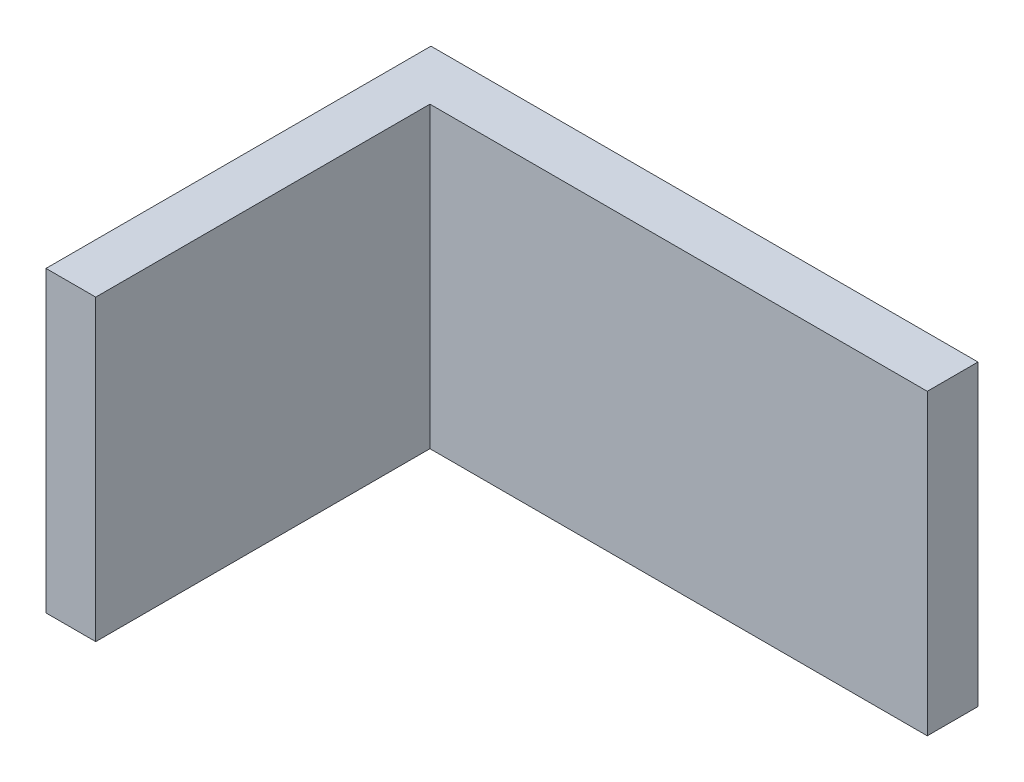
ISO-10303-21;
HEADER;
FILE_DESCRIPTION(('STEP AP214'),'2;1');
FILE_NAME('part.step','',(''),(''),'','','');
FILE_SCHEMA(('AUTOMOTIVE_DESIGN { 1 0 10303 214 1 1 1 1 }'));
ENDSEC;
DATA;
#1=APPLICATION_CONTEXT('core data for automotive mechanical design processes');
#2=APPLICATION_PROTOCOL_DEFINITION('international standard','automotive_design',2000,#1);
#3=PRODUCT_CONTEXT('',#1,'mechanical');
#4=PRODUCT('Part','Part','',(#3));
#5=PRODUCT_RELATED_PRODUCT_CATEGORY('part','',(#4));
#6=PRODUCT_DEFINITION_FORMATION('','',#4);
#7=PRODUCT_DEFINITION_CONTEXT('part definition',#1,'design');
#8=PRODUCT_DEFINITION('design','',#6,#7);
#9=PRODUCT_DEFINITION_SHAPE('','',#8);
#10=(LENGTH_UNIT() NAMED_UNIT(*) SI_UNIT(.MILLI.,.METRE.));
#11=(NAMED_UNIT(*) PLANE_ANGLE_UNIT() SI_UNIT($,.RADIAN.));
#12=(NAMED_UNIT(*) SI_UNIT($,.STERADIAN.) SOLID_ANGLE_UNIT());
#13=UNCERTAINTY_MEASURE_WITH_UNIT(LENGTH_MEASURE(1.E-05),#10,'distance_accuracy_value','');
#14=(GEOMETRIC_REPRESENTATION_CONTEXT(3) GLOBAL_UNCERTAINTY_ASSIGNED_CONTEXT((#13)) GLOBAL_UNIT_ASSIGNED_CONTEXT((#10,
#11,#12)) REPRESENTATION_CONTEXT('',''));
#15=CARTESIAN_POINT('',(0.,0.,0.));
#16=DIRECTION('',(0.,0.,1.));
#17=DIRECTION('',(1.,0.,0.));
#18=AXIS2_PLACEMENT_3D('',#15,#16,#17);
#19=CARTESIAN_POINT('',(-4.55,1.6,0.));
#20=DIRECTION('',(0.,-1.,0.));
#21=DIRECTION('',(0.,0.,1.));
#22=AXIS2_PLACEMENT_3D('',#19,#20,#21);
#23=PLANE('',#22);
#24=DIRECTION('',(-1.,0.,0.));
#25=VECTOR('',#24,1.);
#26=CARTESIAN_POINT('',(-4.,1.6,0.));
#27=LINE('',#26,#25);
#28=CARTESIAN_POINT('',(-4.,1.6,0.));
#29=VERTEX_POINT('',#28);
#30=CARTESIAN_POINT('',(-4.55,1.6,0.));
#31=VERTEX_POINT('',#30);
#32=EDGE_CURVE('E11',#29,#31,#27,.T.);
#33=ORIENTED_EDGE('',*,*,#32,.F.);
#34=DIRECTION('',(0.,0.,-1.));
#35=VECTOR('',#34,1.);
#36=CARTESIAN_POINT('',(-4.,1.6,0.051));
#37=LINE('',#36,#35);
#38=CARTESIAN_POINT('',(-4.,1.6,0.051));
#39=VERTEX_POINT('',#38);
#40=EDGE_CURVE('E24',#39,#29,#37,.T.);
#41=ORIENTED_EDGE('',*,*,#40,.F.);
#42=DIRECTION('',(1.,0.,0.));
#43=VECTOR('',#42,1.);
#44=CARTESIAN_POINT('',(-4.5,1.6,0.051));
#45=LINE('',#44,#43);
#46=CARTESIAN_POINT('',(-4.5,1.6,0.051));
#47=VERTEX_POINT('',#46);
#48=EDGE_CURVE('E87',#47,#39,#45,.T.);
#49=ORIENTED_EDGE('',*,*,#48,.F.);
#50=DIRECTION('',(0.,0.,-1.));
#51=VECTOR('',#50,1.);
#52=CARTESIAN_POINT('',(-4.5,1.6,0.387));
#53=LINE('',#52,#51);
#54=CARTESIAN_POINT('',(-4.5,1.6,0.387));
#55=VERTEX_POINT('',#54);
#56=EDGE_CURVE('E114',#55,#47,#53,.T.);
#57=ORIENTED_EDGE('',*,*,#56,.F.);
#58=DIRECTION('',(1.,0.,0.));
#59=VECTOR('',#58,1.);
#60=CARTESIAN_POINT('',(-4.55,1.6,0.387));
#61=LINE('',#60,#59);
#62=CARTESIAN_POINT('',(-4.55,1.6,0.387));
#63=VERTEX_POINT('',#62);
#64=EDGE_CURVE('E111',#63,#55,#61,.T.);
#65=ORIENTED_EDGE('',*,*,#64,.F.);
#66=DIRECTION('',(0.,0.,1.));
#67=VECTOR('',#66,1.);
#68=CARTESIAN_POINT('',(-4.55,1.6,0.));
#69=LINE('',#68,#67);
#70=EDGE_CURVE('E108',#31,#63,#69,.T.);
#71=ORIENTED_EDGE('',*,*,#70,.F.);
#72=EDGE_LOOP('',(#33,#41,#49,#57,#65,#71));
#73=FACE_BOUND('',#72,.T.);
#74=ADVANCED_FACE('F17',(#73),#23,.T.);
#75=CARTESIAN_POINT('',(-4.,1.9,0.));
#76=DIRECTION('',(0.,1.,0.));
#77=DIRECTION('',(0.,0.,1.));
#78=AXIS2_PLACEMENT_3D('',#75,#76,#77);
#79=PLANE('',#78);
#80=DIRECTION('',(1.,0.,0.));
#81=VECTOR('',#80,1.);
#82=CARTESIAN_POINT('',(-4.55,1.9,0.));
#83=LINE('',#82,#81);
#84=CARTESIAN_POINT('',(-4.55,1.9,0.));
#85=VERTEX_POINT('',#84);
#86=CARTESIAN_POINT('',(-4.,1.9,0.));
#87=VERTEX_POINT('',#86);
#88=EDGE_CURVE('E106',#85,#87,#83,.T.);
#89=ORIENTED_EDGE('',*,*,#88,.F.);
#90=DIRECTION('',(0.,0.,-1.));
#91=VECTOR('',#90,1.);
#92=CARTESIAN_POINT('',(-4.55,1.9,0.387));
#93=LINE('',#92,#91);
#94=CARTESIAN_POINT('',(-4.55,1.9,0.387));
#95=VERTEX_POINT('',#94);
#96=EDGE_CURVE('E103',#95,#85,#93,.T.);
#97=ORIENTED_EDGE('',*,*,#96,.F.);
#98=DIRECTION('',(-1.,0.,0.));
#99=VECTOR('',#98,1.);
#100=CARTESIAN_POINT('',(-4.5,1.9,0.387));
#101=LINE('',#100,#99);
#102=CARTESIAN_POINT('',(-4.5,1.9,0.387));
#103=VERTEX_POINT('',#102);
#104=EDGE_CURVE('E100',#103,#95,#101,.T.);
#105=ORIENTED_EDGE('',*,*,#104,.F.);
#106=DIRECTION('',(0.,0.,1.));
#107=VECTOR('',#106,1.);
#108=CARTESIAN_POINT('',(-4.5,1.9,0.051));
#109=LINE('',#108,#107);
#110=CARTESIAN_POINT('',(-4.5,1.9,0.051));
#111=VERTEX_POINT('',#110);
#112=EDGE_CURVE('E72',#111,#103,#109,.T.);
#113=ORIENTED_EDGE('',*,*,#112,.F.);
#114=DIRECTION('',(-1.,0.,0.));
#115=VECTOR('',#114,1.);
#116=CARTESIAN_POINT('',(-4.,1.9,0.051));
#117=LINE('',#116,#115);
#118=CARTESIAN_POINT('',(-4.,1.9,0.051));
#119=VERTEX_POINT('',#118);
#120=EDGE_CURVE('E66',#119,#111,#117,.T.);
#121=ORIENTED_EDGE('',*,*,#120,.F.);
#122=DIRECTION('',(0.,0.,1.));
#123=VECTOR('',#122,1.);
#124=CARTESIAN_POINT('',(-4.,1.9,0.));
#125=LINE('',#124,#123);
#126=EDGE_CURVE('E69',#87,#119,#125,.T.);
#127=ORIENTED_EDGE('',*,*,#126,.F.);
#128=EDGE_LOOP('',(#89,#97,#105,#113,#121,#127));
#129=FACE_BOUND('',#128,.T.);
#130=ADVANCED_FACE('F68',(#129),#79,.T.);
#131=CARTESIAN_POINT('',(-4.55,1.6,0.387));
#132=DIRECTION('',(0.,0.,1.));
#133=DIRECTION('',(0.,1.,0.));
#134=AXIS2_PLACEMENT_3D('',#131,#132,#133);
#135=PLANE('',#134);
#136=ORIENTED_EDGE('',*,*,#64,.T.);
#137=DIRECTION('',(0.,-1.,0.));
#138=VECTOR('',#137,1.);
#139=CARTESIAN_POINT('',(-4.5,1.9,0.387));
#140=LINE('',#139,#138);
#141=EDGE_CURVE('E83',#103,#55,#140,.T.);
#142=ORIENTED_EDGE('',*,*,#141,.F.);
#143=ORIENTED_EDGE('',*,*,#104,.T.);
#144=DIRECTION('',(0.,1.,0.));
#145=VECTOR('',#144,1.);
#146=CARTESIAN_POINT('',(-4.55,1.6,0.387));
#147=LINE('',#146,#145);
#148=EDGE_CURVE('E88',#63,#95,#147,.T.);
#149=ORIENTED_EDGE('',*,*,#148,.F.);
#150=EDGE_LOOP('',(#136,#142,#143,#149));
#151=FACE_BOUND('',#150,.T.);
#152=ADVANCED_FACE('F125',(#151),#135,.T.);
#153=CARTESIAN_POINT('',(-4.5,1.6,0.051));
#154=DIRECTION('',(0.,0.,1.));
#155=DIRECTION('',(0.,1.,0.));
#156=AXIS2_PLACEMENT_3D('',#153,#154,#155);
#157=PLANE('',#156);
#158=ORIENTED_EDGE('',*,*,#48,.T.);
#159=DIRECTION('',(0.,-1.,0.));
#160=VECTOR('',#159,1.);
#161=CARTESIAN_POINT('',(-4.,1.9,0.051));
#162=LINE('',#161,#160);
#163=EDGE_CURVE('E81',#119,#39,#162,.T.);
#164=ORIENTED_EDGE('',*,*,#163,.F.);
#165=ORIENTED_EDGE('',*,*,#120,.T.);
#166=DIRECTION('',(0.,1.,0.));
#167=VECTOR('',#166,1.);
#168=CARTESIAN_POINT('',(-4.5,1.6,0.051));
#169=LINE('',#168,#167);
#170=EDGE_CURVE('E89',#47,#111,#169,.T.);
#171=ORIENTED_EDGE('',*,*,#170,.F.);
#172=EDGE_LOOP('',(#158,#164,#165,#171));
#173=FACE_BOUND('',#172,.T.);
#174=ADVANCED_FACE('F86',(#173),#157,.T.);
#175=CARTESIAN_POINT('',(-4.55,1.9,0.));
#176=DIRECTION('',(-1.,0.,0.));
#177=DIRECTION('',(0.,0.,1.));
#178=AXIS2_PLACEMENT_3D('',#175,#176,#177);
#179=PLANE('',#178);
#180=DIRECTION('',(0.,1.,0.));
#181=VECTOR('',#180,1.);
#182=CARTESIAN_POINT('',(-4.55,1.6,0.));
#183=LINE('',#182,#181);
#184=EDGE_CURVE('E93',#31,#85,#183,.T.);
#185=ORIENTED_EDGE('',*,*,#184,.F.);
#186=ORIENTED_EDGE('',*,*,#70,.T.);
#187=ORIENTED_EDGE('',*,*,#148,.T.);
#188=ORIENTED_EDGE('',*,*,#96,.T.);
#189=EDGE_LOOP('',(#185,#186,#187,#188));
#190=FACE_BOUND('',#189,.T.);
#191=ADVANCED_FACE('F121',(#190),#179,.T.);
#192=CARTESIAN_POINT('',(-4.,1.6,0.));
#193=DIRECTION('',(1.,0.,0.));
#194=DIRECTION('',(0.,0.,1.));
#195=AXIS2_PLACEMENT_3D('',#192,#193,#194);
#196=PLANE('',#195);
#197=DIRECTION('',(0.,-1.,0.));
#198=VECTOR('',#197,1.);
#199=CARTESIAN_POINT('',(-4.,1.9,0.));
#200=LINE('',#199,#198);
#201=EDGE_CURVE('E82',#87,#29,#200,.T.);
#202=ORIENTED_EDGE('',*,*,#201,.F.);
#203=ORIENTED_EDGE('',*,*,#126,.T.);
#204=ORIENTED_EDGE('',*,*,#163,.T.);
#205=ORIENTED_EDGE('',*,*,#40,.T.);
#206=EDGE_LOOP('',(#202,#203,#204,#205));
#207=FACE_BOUND('',#206,.T.);
#208=ADVANCED_FACE('F80',(#207),#196,.T.);
#209=CARTESIAN_POINT('',(-4.5,1.6,0.051));
#210=DIRECTION('',(1.,0.,0.));
#211=DIRECTION('',(0.,0.,1.));
#212=AXIS2_PLACEMENT_3D('',#209,#210,#211);
#213=PLANE('',#212);
#214=ORIENTED_EDGE('',*,*,#170,.T.);
#215=ORIENTED_EDGE('',*,*,#112,.T.);
#216=ORIENTED_EDGE('',*,*,#141,.T.);
#217=ORIENTED_EDGE('',*,*,#56,.T.);
#218=EDGE_LOOP('',(#214,#215,#216,#217));
#219=FACE_BOUND('',#218,.T.);
#220=ADVANCED_FACE('F127',(#219),#213,.T.);
#221=CARTESIAN_POINT('',(-4.55,1.9,0.));
#222=DIRECTION('',(0.,0.,-1.));
#223=DIRECTION('',(0.,1.,0.));
#224=AXIS2_PLACEMENT_3D('',#221,#222,#223);
#225=PLANE('',#224);
#226=ORIENTED_EDGE('',*,*,#88,.T.);
#227=ORIENTED_EDGE('',*,*,#201,.T.);
#228=ORIENTED_EDGE('',*,*,#32,.T.);
#229=ORIENTED_EDGE('',*,*,#184,.T.);
#230=EDGE_LOOP('',(#226,#227,#228,#229));
#231=FACE_BOUND('',#230,.T.);
#232=ADVANCED_FACE('F117',(#231),#225,.T.);
#233=CLOSED_SHELL('',(#74,#130,#152,#174,#191,#208,#220,#232));
#234=MANIFOLD_SOLID_BREP('B1',#233);
#235=ADVANCED_BREP_SHAPE_REPRESENTATION('',(#18,#234),#14);
#236=SHAPE_DEFINITION_REPRESENTATION(#9,#235);
ENDSEC;
END-ISO-10303-21;
